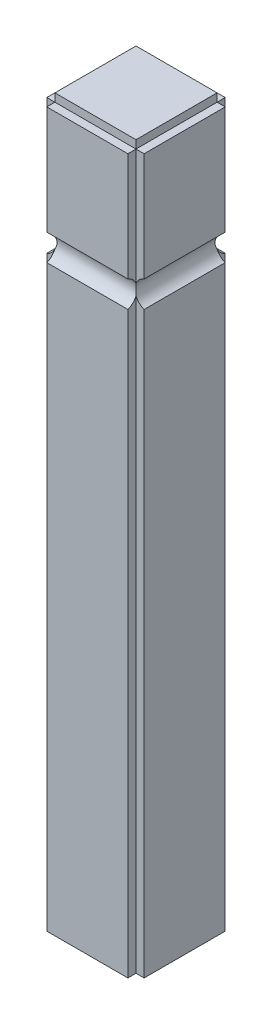
ISO-10303-21;
HEADER;
FILE_DESCRIPTION(('STEP AP214'),'2;1');
FILE_NAME('part.step','',(''),(''),'','','');
FILE_SCHEMA(('AUTOMOTIVE_DESIGN { 1 0 10303 214 1 1 1 1 }'));
ENDSEC;
DATA;
#1=APPLICATION_CONTEXT('core data for automotive mechanical design processes');
#2=APPLICATION_PROTOCOL_DEFINITION('international standard','automotive_design',2000,#1);
#3=PRODUCT_CONTEXT('',#1,'mechanical');
#4=PRODUCT('Part','Part','',(#3));
#5=PRODUCT_RELATED_PRODUCT_CATEGORY('part','',(#4));
#6=PRODUCT_DEFINITION_FORMATION('','',#4);
#7=PRODUCT_DEFINITION_CONTEXT('part definition',#1,'design');
#8=PRODUCT_DEFINITION('design','',#6,#7);
#9=PRODUCT_DEFINITION_SHAPE('','',#8);
#10=(LENGTH_UNIT() NAMED_UNIT(*) SI_UNIT(.MILLI.,.METRE.));
#11=(NAMED_UNIT(*) PLANE_ANGLE_UNIT() SI_UNIT($,.RADIAN.));
#12=(NAMED_UNIT(*) SI_UNIT($,.STERADIAN.) SOLID_ANGLE_UNIT());
#13=UNCERTAINTY_MEASURE_WITH_UNIT(LENGTH_MEASURE(1.E-05),#10,'distance_accuracy_value','');
#14=(GEOMETRIC_REPRESENTATION_CONTEXT(3) GLOBAL_UNCERTAINTY_ASSIGNED_CONTEXT((#13)) GLOBAL_UNIT_ASSIGNED_CONTEXT((#10,
#11,#12)) REPRESENTATION_CONTEXT('',''));
#15=CARTESIAN_POINT('',(0.,0.,0.));
#16=DIRECTION('',(0.,0.,1.));
#17=DIRECTION('',(1.,0.,0.));
#18=AXIS2_PLACEMENT_3D('',#15,#16,#17);
#19=CARTESIAN_POINT('',(0.,0.,0.));
#20=DIRECTION('',(0.,-1.,0.));
#21=DIRECTION('',(0.,0.,-1.));
#22=AXIS2_PLACEMENT_3D('',#19,#20,#21);
#23=PLANE('',#22);
#24=DIRECTION('',(0.,0.,1.));
#25=VECTOR('',#24,1.);
#26=CARTESIAN_POINT('',(15.,0.,-165.));
#27=LINE('',#26,#25);
#28=CARTESIAN_POINT('',(15.,0.,-165.));
#29=VERTEX_POINT('',#28);
#30=CARTESIAN_POINT('',(15.,0.,-15.));
#31=VERTEX_POINT('',#30);
#32=EDGE_CURVE('E235',#29,#31,#27,.T.);
#33=ORIENTED_EDGE('',*,*,#32,.F.);
#34=DIRECTION('',(1.,0.,0.));
#35=VECTOR('',#34,1.);
#36=CARTESIAN_POINT('',(0.,0.,-165.));
#37=LINE('',#36,#35);
#38=CARTESIAN_POINT('',(0.,0.,-165.));
#39=VERTEX_POINT('',#38);
#40=EDGE_CURVE('E346',#39,#29,#37,.T.);
#41=ORIENTED_EDGE('',*,*,#40,.F.);
#42=DIRECTION('',(0.,0.,1.));
#43=VECTOR('',#42,1.);
#44=CARTESIAN_POINT('',(0.,0.,0.));
#45=LINE('',#44,#43);
#46=CARTESIAN_POINT('',(0.,0.,-15.));
#47=VERTEX_POINT('',#46);
#48=EDGE_CURVE('E390',#39,#47,#45,.T.);
#49=ORIENTED_EDGE('',*,*,#48,.T.);
#50=DIRECTION('',(-1.,0.,0.));
#51=VECTOR('',#50,1.);
#52=CARTESIAN_POINT('',(0.,0.,-15.));
#53=LINE('',#52,#51);
#54=EDGE_CURVE('E333',#31,#47,#53,.T.);
#55=ORIENTED_EDGE('',*,*,#54,.F.);
#56=EDGE_LOOP('',(#33,#41,#49,#55));
#57=FACE_BOUND('',#56,.T.);
#58=ADVANCED_FACE('F34',(#57),#23,.F.);
#59=DIRECTION('',(-1.,0.,0.));
#60=VECTOR('',#59,1.);
#61=CARTESIAN_POINT('',(165.,0.,-165.));
#62=LINE('',#61,#60);
#63=CARTESIAN_POINT('',(165.,0.,-165.));
#64=VERTEX_POINT('',#63);
#65=EDGE_CURVE('E232',#64,#29,#62,.T.);
#66=ORIENTED_EDGE('',*,*,#65,.F.);
#67=DIRECTION('',(0.,0.,1.));
#68=VECTOR('',#67,1.);
#69=CARTESIAN_POINT('',(165.,0.,-180.));
#70=LINE('',#69,#68);
#71=CARTESIAN_POINT('',(165.,0.,-180.));
#72=VERTEX_POINT('',#71);
#73=EDGE_CURVE('E320',#72,#64,#70,.T.);
#74=ORIENTED_EDGE('',*,*,#73,.F.);
#75=DIRECTION('',(-1.,0.,0.));
#76=VECTOR('',#75,1.);
#77=CARTESIAN_POINT('',(0.,0.,-180.));
#78=LINE('',#77,#76);
#79=CARTESIAN_POINT('',(15.,0.,-180.));
#80=VERTEX_POINT('',#79);
#81=EDGE_CURVE('E403',#72,#80,#78,.T.);
#82=ORIENTED_EDGE('',*,*,#81,.T.);
#83=DIRECTION('',(0.,0.,-1.));
#84=VECTOR('',#83,1.);
#85=CARTESIAN_POINT('',(15.,0.,-180.));
#86=LINE('',#85,#84);
#87=EDGE_CURVE('E379',#29,#80,#86,.T.);
#88=ORIENTED_EDGE('',*,*,#87,.F.);
#89=EDGE_LOOP('',(#66,#74,#82,#88));
#90=FACE_BOUND('',#89,.T.);
#91=ADVANCED_FACE('F489',(#90),#23,.F.);
#92=DIRECTION('',(0.,0.,-1.));
#93=VECTOR('',#92,1.);
#94=CARTESIAN_POINT('',(165.,0.,-15.));
#95=LINE('',#94,#93);
#96=CARTESIAN_POINT('',(165.,0.,-15.));
#97=VERTEX_POINT('',#96);
#98=EDGE_CURVE('E510',#97,#64,#95,.T.);
#99=ORIENTED_EDGE('',*,*,#98,.F.);
#100=DIRECTION('',(-1.,0.,0.));
#101=VECTOR('',#100,1.);
#102=CARTESIAN_POINT('',(180.,0.,-15.));
#103=LINE('',#102,#101);
#104=CARTESIAN_POINT('',(180.,0.,-15.));
#105=VERTEX_POINT('',#104);
#106=EDGE_CURVE('E313',#105,#97,#103,.T.);
#107=ORIENTED_EDGE('',*,*,#106,.F.);
#108=DIRECTION('',(0.,0.,-1.));
#109=VECTOR('',#108,1.);
#110=CARTESIAN_POINT('',(180.,0.,0.));
#111=LINE('',#110,#109);
#112=CARTESIAN_POINT('',(180.,0.,-165.));
#113=VERTEX_POINT('',#112);
#114=EDGE_CURVE('E417',#105,#113,#111,.T.);
#115=ORIENTED_EDGE('',*,*,#114,.T.);
#116=DIRECTION('',(1.,0.,0.));
#117=VECTOR('',#116,1.);
#118=CARTESIAN_POINT('',(180.,0.,-165.));
#119=LINE('',#118,#117);
#120=EDGE_CURVE('E359',#64,#113,#119,.T.);
#121=ORIENTED_EDGE('',*,*,#120,.F.);
#122=EDGE_LOOP('',(#99,#107,#115,#121));
#123=FACE_BOUND('',#122,.T.);
#124=ADVANCED_FACE('F496',(#123),#23,.F.);
#125=DIRECTION('',(1.,0.,0.));
#126=VECTOR('',#125,1.);
#127=CARTESIAN_POINT('',(15.,0.,-15.));
#128=LINE('',#127,#126);
#129=EDGE_CURVE('E507',#31,#97,#128,.T.);
#130=ORIENTED_EDGE('',*,*,#129,.F.);
#131=DIRECTION('',(0.,0.,-1.));
#132=VECTOR('',#131,1.);
#133=CARTESIAN_POINT('',(15.,0.,0.));
#134=LINE('',#133,#132);
#135=CARTESIAN_POINT('',(15.,0.,0.));
#136=VERTEX_POINT('',#135);
#137=EDGE_CURVE('E337',#136,#31,#134,.T.);
#138=ORIENTED_EDGE('',*,*,#137,.F.);
#139=DIRECTION('',(1.,0.,0.));
#140=VECTOR('',#139,1.);
#141=CARTESIAN_POINT('',(0.,0.,0.));
#142=LINE('',#141,#140);
#143=CARTESIAN_POINT('',(165.,0.,0.));
#144=VERTEX_POINT('',#143);
#145=EDGE_CURVE('E414',#136,#144,#142,.T.);
#146=ORIENTED_EDGE('',*,*,#145,.T.);
#147=DIRECTION('',(0.,0.,1.));
#148=VECTOR('',#147,1.);
#149=CARTESIAN_POINT('',(165.,0.,0.));
#150=LINE('',#149,#148);
#151=EDGE_CURVE('E310',#97,#144,#150,.T.);
#152=ORIENTED_EDGE('',*,*,#151,.F.);
#153=EDGE_LOOP('',(#130,#138,#146,#152));
#154=FACE_BOUND('',#153,.T.);
#155=ADVANCED_FACE('F492',(#154),#23,.F.);
#156=CARTESIAN_POINT('',(0.,-1320.,-180.));
#157=DIRECTION('',(0.,0.,-1.));
#158=DIRECTION('',(-1.,0.,0.));
#159=AXIS2_PLACEMENT_3D('',#156,#157,#158);
#160=PLANE('',#159);
#161=DIRECTION('',(-1.,0.,0.));
#162=VECTOR('',#161,1.);
#163=CARTESIAN_POINT('',(180.,-249.392621835301,-180.));
#164=LINE('',#163,#162);
#165=CARTESIAN_POINT('',(165.,-249.392621835301,-180.));
#166=VERTEX_POINT('',#165);
#167=CARTESIAN_POINT('',(15.0000000000001,-249.392621835301,-180.));
#168=VERTEX_POINT('',#167);
#169=EDGE_CURVE('E245',#166,#168,#164,.T.);
#170=ORIENTED_EDGE('',*,*,#169,.F.);
#171=DIRECTION('',(0.,1.,0.));
#172=VECTOR('',#171,1.);
#173=CARTESIAN_POINT('',(165.,-1320.,-180.));
#174=LINE('',#173,#172);
#175=CARTESIAN_POINT('',(165.,-1320.,-180.));
#176=VERTEX_POINT('',#175);
#177=EDGE_CURVE('E372',#176,#166,#174,.T.);
#178=ORIENTED_EDGE('',*,*,#177,.F.);
#179=DIRECTION('',(-1.,0.,0.));
#180=VECTOR('',#179,1.);
#181=CARTESIAN_POINT('',(0.,-1320.,-180.));
#182=LINE('',#181,#180);
#183=CARTESIAN_POINT('',(15.,-1320.,-180.));
#184=VERTEX_POINT('',#183);
#185=EDGE_CURVE('E409',#176,#184,#182,.T.);
#186=ORIENTED_EDGE('',*,*,#185,.T.);
#187=DIRECTION('',(0.,1.,0.));
#188=VECTOR('',#187,1.);
#189=CARTESIAN_POINT('',(15.,-1320.,-180.));
#190=LINE('',#189,#188);
#191=EDGE_CURVE('E387',#184,#168,#190,.T.);
#192=ORIENTED_EDGE('',*,*,#191,.T.);
#193=EDGE_LOOP('',(#170,#178,#186,#192));
#194=FACE_BOUND('',#193,.T.);
#195=ADVANCED_FACE('F451',(#194),#160,.T.);
#196=CARTESIAN_POINT('',(0.,-1320.,0.));
#197=DIRECTION('',(0.,0.,1.));
#198=DIRECTION('',(1.,0.,0.));
#199=AXIS2_PLACEMENT_3D('',#196,#197,#198);
#200=PLANE('',#199);
#201=DIRECTION('',(-1.,0.,0.));
#202=VECTOR('',#201,1.);
#203=CARTESIAN_POINT('',(180.,-200.607378164699,0.));
#204=LINE('',#203,#202);
#205=CARTESIAN_POINT('',(165.,-200.607378164699,0.));
#206=VERTEX_POINT('',#205);
#207=CARTESIAN_POINT('',(15.,-200.607378164699,0.));
#208=VERTEX_POINT('',#207);
#209=EDGE_CURVE('E239',#206,#208,#204,.T.);
#210=ORIENTED_EDGE('',*,*,#209,.F.);
#211=DIRECTION('',(0.,1.,0.));
#212=VECTOR('',#211,1.);
#213=CARTESIAN_POINT('',(165.,-1320.,0.));
#214=LINE('',#213,#212);
#215=EDGE_CURVE('E321',#206,#144,#214,.T.);
#216=ORIENTED_EDGE('',*,*,#215,.T.);
#217=ORIENTED_EDGE('',*,*,#145,.F.);
#218=DIRECTION('',(0.,1.,0.));
#219=VECTOR('',#218,1.);
#220=CARTESIAN_POINT('',(15.,-1320.,0.));
#221=LINE('',#220,#219);
#222=EDGE_CURVE('E336',#208,#136,#221,.T.);
#223=ORIENTED_EDGE('',*,*,#222,.F.);
#224=EDGE_LOOP('',(#210,#216,#217,#223));
#225=FACE_BOUND('',#224,.T.);
#226=ADVANCED_FACE('F477',(#225),#200,.T.);
#227=CARTESIAN_POINT('',(0.,-1320.,0.));
#228=DIRECTION('',(-1.,0.,0.));
#229=DIRECTION('',(0.,0.,1.));
#230=AXIS2_PLACEMENT_3D('',#227,#228,#229);
#231=PLANE('',#230);
#232=DIRECTION('',(0.,0.,1.));
#233=VECTOR('',#232,1.);
#234=CARTESIAN_POINT('',(0.,-249.392621835301,-180.));
#235=LINE('',#234,#233);
#236=CARTESIAN_POINT('',(0.,-249.392621835301,-165.));
#237=VERTEX_POINT('',#236);
#238=CARTESIAN_POINT('',(0.,-249.392621835301,-15.0000000000001));
#239=VERTEX_POINT('',#238);
#240=EDGE_CURVE('E284',#237,#239,#235,.T.);
#241=ORIENTED_EDGE('',*,*,#240,.F.);
#242=DIRECTION('',(0.,1.,0.));
#243=VECTOR('',#242,1.);
#244=CARTESIAN_POINT('',(0.,-1320.,-165.));
#245=LINE('',#244,#243);
#246=CARTESIAN_POINT('',(0.,-1320.,-165.));
#247=VERTEX_POINT('',#246);
#248=EDGE_CURVE('E396',#247,#237,#245,.T.);
#249=ORIENTED_EDGE('',*,*,#248,.F.);
#250=DIRECTION('',(0.,0.,1.));
#251=VECTOR('',#250,1.);
#252=CARTESIAN_POINT('',(0.,-1320.,0.));
#253=LINE('',#252,#251);
#254=CARTESIAN_POINT('',(0.,-1320.,-15.));
#255=VERTEX_POINT('',#254);
#256=EDGE_CURVE('E399',#247,#255,#253,.T.);
#257=ORIENTED_EDGE('',*,*,#256,.T.);
#258=DIRECTION('',(0.,1.,0.));
#259=VECTOR('',#258,1.);
#260=CARTESIAN_POINT('',(0.,-1320.,-15.));
#261=LINE('',#260,#259);
#262=EDGE_CURVE('E343',#255,#239,#261,.T.);
#263=ORIENTED_EDGE('',*,*,#262,.T.);
#264=EDGE_LOOP('',(#241,#249,#257,#263));
#265=FACE_BOUND('',#264,.T.);
#266=ADVANCED_FACE('F462',(#265),#231,.T.);
#267=CARTESIAN_POINT('',(180.,-1320.,0.));
#268=DIRECTION('',(1.,0.,0.));
#269=DIRECTION('',(0.,0.,-1.));
#270=AXIS2_PLACEMENT_3D('',#267,#268,#269);
#271=PLANE('',#270);
#272=DIRECTION('',(0.,0.,1.));
#273=VECTOR('',#272,1.);
#274=CARTESIAN_POINT('',(180.,-200.607378164699,-180.));
#275=LINE('',#274,#273);
#276=CARTESIAN_POINT('',(180.,-200.607378164699,-165.));
#277=VERTEX_POINT('',#276);
#278=CARTESIAN_POINT('',(180.,-200.607378164699,-15.));
#279=VERTEX_POINT('',#278);
#280=EDGE_CURVE('E285',#277,#279,#275,.T.);
#281=ORIENTED_EDGE('',*,*,#280,.F.);
#282=DIRECTION('',(0.,1.,0.));
#283=VECTOR('',#282,1.);
#284=CARTESIAN_POINT('',(180.,-1320.,-165.));
#285=LINE('',#284,#283);
#286=EDGE_CURVE('E367',#277,#113,#285,.T.);
#287=ORIENTED_EDGE('',*,*,#286,.T.);
#288=ORIENTED_EDGE('',*,*,#114,.F.);
#289=DIRECTION('',(0.,1.,0.));
#290=VECTOR('',#289,1.);
#291=CARTESIAN_POINT('',(180.,-1320.,-15.));
#292=LINE('',#291,#290);
#293=EDGE_CURVE('E57',#279,#105,#292,.T.);
#294=ORIENTED_EDGE('',*,*,#293,.F.);
#295=EDGE_LOOP('',(#281,#287,#288,#294));
#296=FACE_BOUND('',#295,.T.);
#297=ADVANCED_FACE('F485',(#296),#271,.T.);
#298=CARTESIAN_POINT('',(15.,-1320.,-180.));
#299=DIRECTION('',(1.,0.,0.));
#300=DIRECTION('',(0.,0.,-1.));
#301=AXIS2_PLACEMENT_3D('',#298,#299,#300);
#302=PLANE('',#301);
#303=CARTESIAN_POINT('',(15.0000000000001,-200.607378164699,-180.));
#304=VERTEX_POINT('',#303);
#305=EDGE_CURVE('E391',#304,#80,#190,.T.);
#306=ORIENTED_EDGE('',*,*,#305,.F.);
#307=CARTESIAN_POINT('',(15.,-225.,-189.));
#308=DIRECTION('',(1.,0.,0.));
#309=DIRECTION('',(0.,0.,-1.));
#310=AXIS2_PLACEMENT_3D('',#307,#308,#309);
#311=CIRCLE('',#310,26.);
#312=CARTESIAN_POINT('',(15.,-215.,-165.));
#313=VERTEX_POINT('',#312);
#314=EDGE_CURVE('E277',#304,#313,#311,.T.);
#315=ORIENTED_EDGE('',*,*,#314,.T.);
#316=DIRECTION('',(0.,1.,0.));
#317=VECTOR('',#316,1.);
#318=CARTESIAN_POINT('',(15.,-1320.,-165.));
#319=LINE('',#318,#317);
#320=EDGE_CURVE('E395',#313,#29,#319,.T.);
#321=ORIENTED_EDGE('',*,*,#320,.T.);
#322=ORIENTED_EDGE('',*,*,#87,.T.);
#323=EDGE_LOOP('',(#306,#315,#321,#322));
#324=FACE_BOUND('',#323,.T.);
#325=ADVANCED_FACE('F533',(#324),#302,.F.);
#326=CARTESIAN_POINT('',(0.,-1320.,-165.));
#327=DIRECTION('',(0.,0.,1.));
#328=DIRECTION('',(1.,0.,0.));
#329=AXIS2_PLACEMENT_3D('',#326,#327,#328);
#330=PLANE('',#329);
#331=ORIENTED_EDGE('',*,*,#320,.F.);
#332=CARTESIAN_POINT('',(-9.,-225.,-165.));
#333=DIRECTION('',(0.,0.,1.));
#334=DIRECTION('',(1.,0.,0.));
#335=AXIS2_PLACEMENT_3D('',#332,#333,#334);
#336=CIRCLE('',#335,26.);
#337=CARTESIAN_POINT('',(0.,-200.607378164699,-165.));
#338=VERTEX_POINT('',#337);
#339=EDGE_CURVE('E297',#313,#338,#336,.T.);
#340=ORIENTED_EDGE('',*,*,#339,.T.);
#341=EDGE_CURVE('E382',#338,#39,#245,.T.);
#342=ORIENTED_EDGE('',*,*,#341,.T.);
#343=ORIENTED_EDGE('',*,*,#40,.T.);
#344=EDGE_LOOP('',(#331,#340,#342,#343));
#345=FACE_BOUND('',#344,.T.);
#346=ADVANCED_FACE('F529',(#345),#330,.F.);
#347=CARTESIAN_POINT('',(165.,-1320.,0.));
#348=DIRECTION('',(-1.,0.,0.));
#349=DIRECTION('',(0.,0.,1.));
#350=AXIS2_PLACEMENT_3D('',#347,#348,#349);
#351=PLANE('',#350);
#352=DIRECTION('',(0.,1.,0.));
#353=VECTOR('',#352,1.);
#354=CARTESIAN_POINT('',(165.,-1320.,-15.));
#355=LINE('',#354,#353);
#356=CARTESIAN_POINT('',(165.,-1320.,-15.));
#357=VERTEX_POINT('',#356);
#358=CARTESIAN_POINT('',(165.,-235.,-15.));
#359=VERTEX_POINT('',#358);
#360=EDGE_CURVE('E322',#357,#359,#355,.T.);
#361=ORIENTED_EDGE('',*,*,#360,.T.);
#362=CARTESIAN_POINT('',(165.,-225.,9.));
#363=DIRECTION('',(-1.,0.,0.));
#364=DIRECTION('',(0.,0.,1.));
#365=AXIS2_PLACEMENT_3D('',#362,#363,#364);
#366=CIRCLE('',#365,26.);
#367=CARTESIAN_POINT('',(165.,-249.392621835301,0.));
#368=VERTEX_POINT('',#367);
#369=EDGE_CURVE('E254',#359,#368,#366,.T.);
#370=ORIENTED_EDGE('',*,*,#369,.T.);
#371=CARTESIAN_POINT('',(165.,-1320.,0.));
#372=VERTEX_POINT('',#371);
#373=EDGE_CURVE('E317',#372,#368,#214,.T.);
#374=ORIENTED_EDGE('',*,*,#373,.F.);
#375=DIRECTION('',(0.,0.,1.));
#376=VECTOR('',#375,1.);
#377=CARTESIAN_POINT('',(165.,-1320.,0.));
#378=LINE('',#377,#376);
#379=EDGE_CURVE('E309',#357,#372,#378,.T.);
#380=ORIENTED_EDGE('',*,*,#379,.F.);
#381=EDGE_LOOP('',(#361,#370,#374,#380));
#382=FACE_BOUND('',#381,.T.);
#383=ADVANCED_FACE('F433',(#382),#351,.F.);
#384=CARTESIAN_POINT('',(180.,-1320.,-15.));
#385=DIRECTION('',(0.,0.,-1.));
#386=DIRECTION('',(-1.,0.,0.));
#387=AXIS2_PLACEMENT_3D('',#384,#385,#386);
#388=PLANE('',#387);
#389=CARTESIAN_POINT('',(165.,-215.,-15.));
#390=VERTEX_POINT('',#389);
#391=EDGE_CURVE('E325',#390,#97,#355,.T.);
#392=ORIENTED_EDGE('',*,*,#391,.F.);
#393=CARTESIAN_POINT('',(189.,-225.,-15.));
#394=DIRECTION('',(0.,0.,-1.));
#395=DIRECTION('',(-1.,0.,0.));
#396=AXIS2_PLACEMENT_3D('',#393,#394,#395);
#397=CIRCLE('',#396,26.);
#398=EDGE_CURVE('E305',#390,#279,#397,.T.);
#399=ORIENTED_EDGE('',*,*,#398,.T.);
#400=ORIENTED_EDGE('',*,*,#293,.T.);
#401=ORIENTED_EDGE('',*,*,#106,.T.);
#402=EDGE_LOOP('',(#392,#399,#400,#401));
#403=FACE_BOUND('',#402,.T.);
#404=ADVANCED_FACE('F586',(#403),#388,.F.);
#405=CARTESIAN_POINT('',(180.,-1320.,-165.));
#406=DIRECTION('',(0.,0.,1.));
#407=DIRECTION('',(1.,0.,0.));
#408=AXIS2_PLACEMENT_3D('',#405,#406,#407);
#409=PLANE('',#408);
#410=ORIENTED_EDGE('',*,*,#286,.F.);
#411=CARTESIAN_POINT('',(189.,-225.,-165.));
#412=DIRECTION('',(0.,0.,1.));
#413=DIRECTION('',(1.,0.,0.));
#414=AXIS2_PLACEMENT_3D('',#411,#412,#413);
#415=CIRCLE('',#414,26.);
#416=CARTESIAN_POINT('',(165.,-215.,-165.));
#417=VERTEX_POINT('',#416);
#418=EDGE_CURVE('E298',#277,#417,#415,.T.);
#419=ORIENTED_EDGE('',*,*,#418,.T.);
#420=DIRECTION('',(0.,1.,0.));
#421=VECTOR('',#420,1.);
#422=CARTESIAN_POINT('',(165.,-1320.,-165.));
#423=LINE('',#422,#421);
#424=EDGE_CURVE('E371',#417,#64,#423,.T.);
#425=ORIENTED_EDGE('',*,*,#424,.T.);
#426=ORIENTED_EDGE('',*,*,#120,.T.);
#427=EDGE_LOOP('',(#410,#419,#425,#426));
#428=FACE_BOUND('',#427,.T.);
#429=ADVANCED_FACE('F593',(#428),#409,.F.);
#430=CARTESIAN_POINT('',(165.,-1320.,-180.));
#431=DIRECTION('',(-1.,0.,0.));
#432=DIRECTION('',(0.,0.,1.));
#433=AXIS2_PLACEMENT_3D('',#430,#431,#432);
#434=PLANE('',#433);
#435=ORIENTED_EDGE('',*,*,#177,.T.);
#436=CARTESIAN_POINT('',(165.,-225.,-189.));
#437=DIRECTION('',(-1.,0.,0.));
#438=DIRECTION('',(0.,0.,1.));
#439=AXIS2_PLACEMENT_3D('',#436,#437,#438);
#440=CIRCLE('',#439,26.);
#441=CARTESIAN_POINT('',(165.,-235.,-165.));
#442=VERTEX_POINT('',#441);
#443=EDGE_CURVE('E268',#166,#442,#440,.T.);
#444=ORIENTED_EDGE('',*,*,#443,.T.);
#445=CARTESIAN_POINT('',(165.,-1320.,-165.));
#446=VERTEX_POINT('',#445);
#447=EDGE_CURVE('E368',#446,#442,#423,.T.);
#448=ORIENTED_EDGE('',*,*,#447,.F.);
#449=DIRECTION('',(0.,0.,1.));
#450=VECTOR('',#449,1.);
#451=CARTESIAN_POINT('',(165.,-1320.,-180.));
#452=LINE('',#451,#450);
#453=EDGE_CURVE('E355',#176,#446,#452,.T.);
#454=ORIENTED_EDGE('',*,*,#453,.F.);
#455=EDGE_LOOP('',(#435,#444,#448,#454));
#456=FACE_BOUND('',#455,.T.);
#457=ADVANCED_FACE('F445',(#456),#434,.F.);
#458=CARTESIAN_POINT('',(0.,-1320.,-15.));
#459=DIRECTION('',(0.,0.,-1.));
#460=DIRECTION('',(-1.,0.,0.));
#461=AXIS2_PLACEMENT_3D('',#458,#459,#460);
#462=PLANE('',#461);
#463=CARTESIAN_POINT('',(0.,-200.607378164699,-15.0000000000001));
#464=VERTEX_POINT('',#463);
#465=EDGE_CURVE('E347',#464,#47,#261,.T.);
#466=ORIENTED_EDGE('',*,*,#465,.F.);
#467=CARTESIAN_POINT('',(-9.,-225.,-15.));
#468=DIRECTION('',(0.,0.,-1.));
#469=DIRECTION('',(-1.,0.,0.));
#470=AXIS2_PLACEMENT_3D('',#467,#468,#469);
#471=CIRCLE('',#470,26.);
#472=CARTESIAN_POINT('',(15.0000000000001,-215.,-15.));
#473=VERTEX_POINT('',#472);
#474=EDGE_CURVE('E293',#464,#473,#471,.T.);
#475=ORIENTED_EDGE('',*,*,#474,.T.);
#476=DIRECTION('',(0.,1.,0.));
#477=VECTOR('',#476,1.);
#478=CARTESIAN_POINT('',(15.,-1320.,-15.));
#479=LINE('',#478,#477);
#480=EDGE_CURVE('E351',#473,#31,#479,.T.);
#481=ORIENTED_EDGE('',*,*,#480,.T.);
#482=ORIENTED_EDGE('',*,*,#54,.T.);
#483=EDGE_LOOP('',(#466,#475,#481,#482));
#484=FACE_BOUND('',#483,.T.);
#485=ADVANCED_FACE('F516',(#484),#462,.F.);
#486=CARTESIAN_POINT('',(15.,-1320.,0.));
#487=DIRECTION('',(1.,0.,0.));
#488=DIRECTION('',(0.,0.,-1.));
#489=AXIS2_PLACEMENT_3D('',#486,#487,#488);
#490=PLANE('',#489);
#491=ORIENTED_EDGE('',*,*,#480,.F.);
#492=CARTESIAN_POINT('',(15.,-225.,9.));
#493=DIRECTION('',(1.,0.,0.));
#494=DIRECTION('',(0.,0.,-1.));
#495=AXIS2_PLACEMENT_3D('',#492,#493,#494);
#496=CIRCLE('',#495,26.);
#497=EDGE_CURVE('E263',#473,#208,#496,.T.);
#498=ORIENTED_EDGE('',*,*,#497,.T.);
#499=ORIENTED_EDGE('',*,*,#222,.T.);
#500=ORIENTED_EDGE('',*,*,#137,.T.);
#501=EDGE_LOOP('',(#491,#498,#499,#500));
#502=FACE_BOUND('',#501,.T.);
#503=ADVANCED_FACE('F519',(#502),#490,.F.);
#504=DIRECTION('',(0.,0.,1.));
#505=VECTOR('',#504,1.);
#506=CARTESIAN_POINT('',(0.,-200.607378164699,-180.));
#507=LINE('',#506,#505);
#508=EDGE_CURVE('E281',#338,#464,#507,.T.);
#509=ORIENTED_EDGE('',*,*,#508,.T.);
#510=ORIENTED_EDGE('',*,*,#465,.T.);
#511=ORIENTED_EDGE('',*,*,#48,.F.);
#512=ORIENTED_EDGE('',*,*,#341,.F.);
#513=EDGE_LOOP('',(#509,#510,#511,#512));
#514=FACE_BOUND('',#513,.T.);
#515=ADVANCED_FACE('F36',(#514),#231,.T.);
#516=DIRECTION('',(-1.,0.,0.));
#517=VECTOR('',#516,1.);
#518=CARTESIAN_POINT('',(180.,-200.607378164699,-180.));
#519=LINE('',#518,#517);
#520=CARTESIAN_POINT('',(165.,-200.607378164699,-180.));
#521=VERTEX_POINT('',#520);
#522=EDGE_CURVE('E248',#521,#304,#519,.T.);
#523=ORIENTED_EDGE('',*,*,#522,.T.);
#524=ORIENTED_EDGE('',*,*,#305,.T.);
#525=ORIENTED_EDGE('',*,*,#81,.F.);
#526=EDGE_CURVE('E49',#521,#72,#174,.T.);
#527=ORIENTED_EDGE('',*,*,#526,.F.);
#528=EDGE_LOOP('',(#523,#524,#525,#527));
#529=FACE_BOUND('',#528,.T.);
#530=ADVANCED_FACE('F483',(#529),#160,.T.);
#531=DIRECTION('',(0.,0.,1.));
#532=VECTOR('',#531,1.);
#533=CARTESIAN_POINT('',(180.,-249.392621835301,-180.));
#534=LINE('',#533,#532);
#535=CARTESIAN_POINT('',(180.,-249.392621835301,-165.));
#536=VERTEX_POINT('',#535);
#537=CARTESIAN_POINT('',(180.,-249.392621835301,-15.));
#538=VERTEX_POINT('',#537);
#539=EDGE_CURVE('E280',#536,#538,#534,.T.);
#540=ORIENTED_EDGE('',*,*,#539,.T.);
#541=CARTESIAN_POINT('',(180.,-1320.,-15.));
#542=VERTEX_POINT('',#541);
#543=EDGE_CURVE('E326',#542,#538,#292,.T.);
#544=ORIENTED_EDGE('',*,*,#543,.F.);
#545=DIRECTION('',(0.,0.,-1.));
#546=VECTOR('',#545,1.);
#547=CARTESIAN_POINT('',(180.,-1320.,0.));
#548=LINE('',#547,#546);
#549=CARTESIAN_POINT('',(180.,-1320.,-165.));
#550=VERTEX_POINT('',#549);
#551=EDGE_CURVE('E406',#542,#550,#548,.T.);
#552=ORIENTED_EDGE('',*,*,#551,.T.);
#553=EDGE_CURVE('E340',#550,#536,#285,.T.);
#554=ORIENTED_EDGE('',*,*,#553,.T.);
#555=EDGE_LOOP('',(#540,#544,#552,#554));
#556=FACE_BOUND('',#555,.T.);
#557=ADVANCED_FACE('F439',(#556),#271,.T.);
#558=DIRECTION('',(-1.,0.,0.));
#559=VECTOR('',#558,1.);
#560=CARTESIAN_POINT('',(180.,-249.392621835301,0.));
#561=LINE('',#560,#559);
#562=CARTESIAN_POINT('',(15.,-249.392621835301,0.));
#563=VERTEX_POINT('',#562);
#564=EDGE_CURVE('E236',#368,#563,#561,.T.);
#565=ORIENTED_EDGE('',*,*,#564,.T.);
#566=CARTESIAN_POINT('',(15.,-1320.,0.));
#567=VERTEX_POINT('',#566);
#568=EDGE_CURVE('E352',#567,#563,#221,.T.);
#569=ORIENTED_EDGE('',*,*,#568,.F.);
#570=DIRECTION('',(1.,0.,0.));
#571=VECTOR('',#570,1.);
#572=CARTESIAN_POINT('',(0.,-1320.,0.));
#573=LINE('',#572,#571);
#574=EDGE_CURVE('E402',#567,#372,#573,.T.);
#575=ORIENTED_EDGE('',*,*,#574,.T.);
#576=ORIENTED_EDGE('',*,*,#373,.T.);
#577=EDGE_LOOP('',(#565,#569,#575,#576));
#578=FACE_BOUND('',#577,.T.);
#579=ADVANCED_FACE('F475',(#578),#200,.T.);
#580=CARTESIAN_POINT('',(0.,-1320.,0.));
#581=DIRECTION('',(0.,-1.,0.));
#582=DIRECTION('',(0.,0.,-1.));
#583=AXIS2_PLACEMENT_3D('',#580,#581,#582);
#584=PLANE('',#583);
#585=DIRECTION('',(-1.,0.,0.));
#586=VECTOR('',#585,1.);
#587=CARTESIAN_POINT('',(0.,-1320.,-15.));
#588=LINE('',#587,#586);
#589=CARTESIAN_POINT('',(15.,-1320.,-15.));
#590=VERTEX_POINT('',#589);
#591=EDGE_CURVE('E332',#590,#255,#588,.T.);
#592=ORIENTED_EDGE('',*,*,#591,.T.);
#593=ORIENTED_EDGE('',*,*,#256,.F.);
#594=DIRECTION('',(1.,0.,0.));
#595=VECTOR('',#594,1.);
#596=CARTESIAN_POINT('',(0.,-1320.,-165.));
#597=LINE('',#596,#595);
#598=CARTESIAN_POINT('',(15.,-1320.,-165.));
#599=VERTEX_POINT('',#598);
#600=EDGE_CURVE('E375',#247,#599,#597,.T.);
#601=ORIENTED_EDGE('',*,*,#600,.T.);
#602=DIRECTION('',(0.,0.,-1.));
#603=VECTOR('',#602,1.);
#604=CARTESIAN_POINT('',(15.,-1320.,-180.));
#605=LINE('',#604,#603);
#606=EDGE_CURVE('E378',#599,#184,#605,.T.);
#607=ORIENTED_EDGE('',*,*,#606,.T.);
#608=ORIENTED_EDGE('',*,*,#185,.F.);
#609=ORIENTED_EDGE('',*,*,#453,.T.);
#610=DIRECTION('',(1.,0.,0.));
#611=VECTOR('',#610,1.);
#612=CARTESIAN_POINT('',(180.,-1320.,-165.));
#613=LINE('',#612,#611);
#614=EDGE_CURVE('E358',#446,#550,#613,.T.);
#615=ORIENTED_EDGE('',*,*,#614,.T.);
#616=ORIENTED_EDGE('',*,*,#551,.F.);
#617=DIRECTION('',(-1.,0.,0.));
#618=VECTOR('',#617,1.);
#619=CARTESIAN_POINT('',(180.,-1320.,-15.));
#620=LINE('',#619,#618);
#621=EDGE_CURVE('E306',#542,#357,#620,.T.);
#622=ORIENTED_EDGE('',*,*,#621,.T.);
#623=ORIENTED_EDGE('',*,*,#379,.T.);
#624=ORIENTED_EDGE('',*,*,#574,.F.);
#625=DIRECTION('',(0.,0.,-1.));
#626=VECTOR('',#625,1.);
#627=CARTESIAN_POINT('',(15.,-1320.,0.));
#628=LINE('',#627,#626);
#629=EDGE_CURVE('E329',#567,#590,#628,.T.);
#630=ORIENTED_EDGE('',*,*,#629,.T.);
#631=EDGE_LOOP('',(#592,#593,#601,#607,#608,#609,#615,#616,#622,#623,#624,#630));
#632=FACE_BOUND('',#631,.T.);
#633=ADVANCED_FACE('F437',(#632),#584,.T.);
#634=CARTESIAN_POINT('',(15.0000000000001,-235.,-165.));
#635=VERTEX_POINT('',#634);
#636=EDGE_CURVE('E392',#599,#635,#319,.T.);
#637=ORIENTED_EDGE('',*,*,#636,.T.);
#638=CARTESIAN_POINT('',(15.,-225.,-189.));
#639=DIRECTION('',(1.,0.,0.));
#640=DIRECTION('',(0.,0.,-1.));
#641=AXIS2_PLACEMENT_3D('',#638,#639,#640);
#642=CIRCLE('',#641,26.);
#643=EDGE_CURVE('E274',#635,#168,#642,.T.);
#644=ORIENTED_EDGE('',*,*,#643,.T.);
#645=ORIENTED_EDGE('',*,*,#191,.F.);
#646=ORIENTED_EDGE('',*,*,#606,.F.);
#647=EDGE_LOOP('',(#637,#644,#645,#646));
#648=FACE_BOUND('',#647,.T.);
#649=ADVANCED_FACE('F455',(#648),#302,.F.);
#650=ORIENTED_EDGE('',*,*,#248,.T.);
#651=EDGE_CURVE('E294',#237,#635,#336,.T.);
#652=ORIENTED_EDGE('',*,*,#651,.T.);
#653=ORIENTED_EDGE('',*,*,#636,.F.);
#654=ORIENTED_EDGE('',*,*,#600,.F.);
#655=EDGE_LOOP('',(#650,#652,#653,#654));
#656=FACE_BOUND('',#655,.T.);
#657=ADVANCED_FACE('F459',(#656),#330,.F.);
#658=ORIENTED_EDGE('',*,*,#215,.F.);
#659=CARTESIAN_POINT('',(165.,-225.,9.));
#660=DIRECTION('',(-1.,0.,0.));
#661=DIRECTION('',(0.,0.,1.));
#662=AXIS2_PLACEMENT_3D('',#659,#660,#661);
#663=CIRCLE('',#662,26.);
#664=EDGE_CURVE('E247',#206,#390,#663,.T.);
#665=ORIENTED_EDGE('',*,*,#664,.T.);
#666=ORIENTED_EDGE('',*,*,#391,.T.);
#667=ORIENTED_EDGE('',*,*,#151,.T.);
#668=EDGE_LOOP('',(#658,#665,#666,#667));
#669=FACE_BOUND('',#668,.T.);
#670=ADVANCED_FACE('F580',(#669),#351,.F.);
#671=ORIENTED_EDGE('',*,*,#543,.T.);
#672=EDGE_CURVE('E302',#538,#359,#397,.T.);
#673=ORIENTED_EDGE('',*,*,#672,.T.);
#674=ORIENTED_EDGE('',*,*,#360,.F.);
#675=ORIENTED_EDGE('',*,*,#621,.F.);
#676=EDGE_LOOP('',(#671,#673,#674,#675));
#677=FACE_BOUND('',#676,.T.);
#678=ADVANCED_FACE('F429',(#677),#388,.F.);
#679=ORIENTED_EDGE('',*,*,#447,.T.);
#680=EDGE_CURVE('E301',#442,#536,#415,.T.);
#681=ORIENTED_EDGE('',*,*,#680,.T.);
#682=ORIENTED_EDGE('',*,*,#553,.F.);
#683=ORIENTED_EDGE('',*,*,#614,.F.);
#684=EDGE_LOOP('',(#679,#681,#682,#683));
#685=FACE_BOUND('',#684,.T.);
#686=ADVANCED_FACE('F442',(#685),#409,.F.);
#687=ORIENTED_EDGE('',*,*,#424,.F.);
#688=CARTESIAN_POINT('',(165.,-225.,-189.));
#689=DIRECTION('',(-1.,0.,0.));
#690=DIRECTION('',(0.,0.,1.));
#691=AXIS2_PLACEMENT_3D('',#688,#689,#690);
#692=CIRCLE('',#691,26.);
#693=EDGE_CURVE('E266',#417,#521,#692,.T.);
#694=ORIENTED_EDGE('',*,*,#693,.T.);
#695=ORIENTED_EDGE('',*,*,#526,.T.);
#696=ORIENTED_EDGE('',*,*,#73,.T.);
#697=EDGE_LOOP('',(#687,#694,#695,#696));
#698=FACE_BOUND('',#697,.T.);
#699=ADVANCED_FACE('F540',(#698),#434,.F.);
#700=CARTESIAN_POINT('',(15.,-235.,-14.9999999999999));
#701=VERTEX_POINT('',#700);
#702=EDGE_CURVE('E348',#590,#701,#479,.T.);
#703=ORIENTED_EDGE('',*,*,#702,.T.);
#704=EDGE_CURVE('E287',#701,#239,#471,.T.);
#705=ORIENTED_EDGE('',*,*,#704,.T.);
#706=ORIENTED_EDGE('',*,*,#262,.F.);
#707=ORIENTED_EDGE('',*,*,#591,.F.);
#708=EDGE_LOOP('',(#703,#705,#706,#707));
#709=FACE_BOUND('',#708,.T.);
#710=ADVANCED_FACE('F468',(#709),#462,.F.);
#711=ORIENTED_EDGE('',*,*,#568,.T.);
#712=CARTESIAN_POINT('',(15.,-225.,9.));
#713=DIRECTION('',(1.,0.,0.));
#714=DIRECTION('',(0.,0.,-1.));
#715=AXIS2_PLACEMENT_3D('',#712,#713,#714);
#716=CIRCLE('',#715,26.);
#717=EDGE_CURVE('E260',#563,#701,#716,.T.);
#718=ORIENTED_EDGE('',*,*,#717,.T.);
#719=ORIENTED_EDGE('',*,*,#702,.F.);
#720=ORIENTED_EDGE('',*,*,#629,.F.);
#721=EDGE_LOOP('',(#711,#718,#719,#720));
#722=FACE_BOUND('',#721,.T.);
#723=ADVANCED_FACE('F471',(#722),#490,.F.);
#724=CARTESIAN_POINT('',(-9.,-225.,-180.));
#725=DIRECTION('',(0.,0.,1.));
#726=DIRECTION('',(1.,0.,0.));
#727=AXIS2_PLACEMENT_3D('',#724,#725,#726);
#728=CYLINDRICAL_SURFACE('',#727,26.);
#729=ORIENTED_EDGE('',*,*,#339,.F.);
#730=CARTESIAN_POINT('',(-8.99999999999998,-225.,-189.));
#731=DIRECTION('',(-0.707106781186547,0.,0.707106781186547));
#732=DIRECTION('',(0.707106781186547,0.,0.707106781186547));
#733=AXIS2_PLACEMENT_3D('',#730,#731,#732);
#734=ELLIPSE('',#733,36.7695526217005,26.);
#735=EDGE_CURVE('E271',#313,#635,#734,.F.);
#736=ORIENTED_EDGE('',*,*,#735,.T.);
#737=ORIENTED_EDGE('',*,*,#651,.F.);
#738=ORIENTED_EDGE('',*,*,#240,.T.);
#739=ORIENTED_EDGE('',*,*,#704,.F.);
#740=CARTESIAN_POINT('',(-8.99999999999998,-225.,9.00000000000002));
#741=DIRECTION('',(0.707106781186547,0.,0.707106781186547));
#742=DIRECTION('',(-0.707106781186547,0.,0.707106781186547));
#743=AXIS2_PLACEMENT_3D('',#740,#741,#742);
#744=ELLIPSE('',#743,36.7695526217005,26.);
#745=EDGE_CURVE('E257',#701,#473,#744,.T.);
#746=ORIENTED_EDGE('',*,*,#745,.T.);
#747=ORIENTED_EDGE('',*,*,#474,.F.);
#748=ORIENTED_EDGE('',*,*,#508,.F.);
#749=EDGE_LOOP('',(#729,#736,#737,#738,#739,#746,#747,#748));
#750=FACE_BOUND('',#749,.T.);
#751=ADVANCED_FACE('F466',(#750),#728,.F.);
#752=CARTESIAN_POINT('',(189.,-225.,-180.));
#753=DIRECTION('',(0.,0.,1.));
#754=DIRECTION('',(1.,0.,0.));
#755=AXIS2_PLACEMENT_3D('',#752,#753,#754);
#756=CYLINDRICAL_SURFACE('',#755,26.);
#757=ORIENTED_EDGE('',*,*,#680,.F.);
#758=CARTESIAN_POINT('',(189.,-225.,-189.));
#759=DIRECTION('',(0.707106781186547,0.,0.707106781186547));
#760=DIRECTION('',(-0.707106781186547,0.,0.707106781186547));
#761=AXIS2_PLACEMENT_3D('',#758,#759,#760);
#762=ELLIPSE('',#761,36.7695526217005,26.);
#763=EDGE_CURVE('E11',#442,#417,#762,.F.);
#764=ORIENTED_EDGE('',*,*,#763,.T.);
#765=ORIENTED_EDGE('',*,*,#418,.F.);
#766=ORIENTED_EDGE('',*,*,#280,.T.);
#767=ORIENTED_EDGE('',*,*,#398,.F.);
#768=CARTESIAN_POINT('',(189.,-225.,9.00000000000002));
#769=DIRECTION('',(-0.707106781186547,0.,0.707106781186547));
#770=DIRECTION('',(0.707106781186547,0.,0.707106781186547));
#771=AXIS2_PLACEMENT_3D('',#768,#769,#770);
#772=ELLIPSE('',#771,36.7695526217005,26.);
#773=EDGE_CURVE('E42',#390,#359,#772,.T.);
#774=ORIENTED_EDGE('',*,*,#773,.T.);
#775=ORIENTED_EDGE('',*,*,#672,.F.);
#776=ORIENTED_EDGE('',*,*,#539,.F.);
#777=EDGE_LOOP('',(#757,#764,#765,#766,#767,#774,#775,#776));
#778=FACE_BOUND('',#777,.T.);
#779=ADVANCED_FACE('F425',(#778),#756,.F.);
#780=CARTESIAN_POINT('',(180.,-225.,9.));
#781=DIRECTION('',(-1.,0.,0.));
#782=DIRECTION('',(0.,0.,1.));
#783=AXIS2_PLACEMENT_3D('',#780,#781,#782);
#784=CYLINDRICAL_SURFACE('',#783,26.);
#785=ORIENTED_EDGE('',*,*,#745,.F.);
#786=ORIENTED_EDGE('',*,*,#717,.F.);
#787=ORIENTED_EDGE('',*,*,#564,.F.);
#788=ORIENTED_EDGE('',*,*,#369,.F.);
#789=ORIENTED_EDGE('',*,*,#773,.F.);
#790=ORIENTED_EDGE('',*,*,#664,.F.);
#791=ORIENTED_EDGE('',*,*,#209,.T.);
#792=ORIENTED_EDGE('',*,*,#497,.F.);
#793=EDGE_LOOP('',(#785,#786,#787,#788,#789,#790,#791,#792));
#794=FACE_BOUND('',#793,.T.);
#795=ADVANCED_FACE('F473',(#794),#784,.F.);
#796=CARTESIAN_POINT('',(180.,-225.,-189.));
#797=DIRECTION('',(-1.,0.,0.));
#798=DIRECTION('',(0.,0.,1.));
#799=AXIS2_PLACEMENT_3D('',#796,#797,#798);
#800=CYLINDRICAL_SURFACE('',#799,26.);
#801=ORIENTED_EDGE('',*,*,#522,.F.);
#802=ORIENTED_EDGE('',*,*,#693,.F.);
#803=ORIENTED_EDGE('',*,*,#763,.F.);
#804=ORIENTED_EDGE('',*,*,#443,.F.);
#805=ORIENTED_EDGE('',*,*,#169,.T.);
#806=ORIENTED_EDGE('',*,*,#643,.F.);
#807=ORIENTED_EDGE('',*,*,#735,.F.);
#808=ORIENTED_EDGE('',*,*,#314,.F.);
#809=EDGE_LOOP('',(#801,#802,#803,#804,#805,#806,#807,#808));
#810=FACE_BOUND('',#809,.T.);
#811=ADVANCED_FACE('F449',(#810),#800,.F.);
#812=CARTESIAN_POINT('',(15.,15.,-165.));
#813=DIRECTION('',(1.,0.,0.));
#814=DIRECTION('',(0.,0.,-1.));
#815=AXIS2_PLACEMENT_3D('',#812,#813,#814);
#816=PLANE('',#815);
#817=ORIENTED_EDGE('',*,*,#32,.T.);
#818=DIRECTION('',(0.,-1.,0.));
#819=VECTOR('',#818,1.);
#820=CARTESIAN_POINT('',(15.,15.,-15.));
#821=LINE('',#820,#819);
#822=CARTESIAN_POINT('',(15.,15.,-15.));
#823=VERTEX_POINT('',#822);
#824=EDGE_CURVE('E216',#823,#31,#821,.T.);
#825=ORIENTED_EDGE('',*,*,#824,.F.);
#826=DIRECTION('',(0.,0.,1.));
#827=VECTOR('',#826,1.);
#828=CARTESIAN_POINT('',(15.,15.,-165.));
#829=LINE('',#828,#827);
#830=CARTESIAN_POINT('',(15.,15.,-165.));
#831=VERTEX_POINT('',#830);
#832=EDGE_CURVE('E223',#831,#823,#829,.T.);
#833=ORIENTED_EDGE('',*,*,#832,.F.);
#834=DIRECTION('',(0.,-1.,0.));
#835=VECTOR('',#834,1.);
#836=CARTESIAN_POINT('',(15.,15.,-165.));
#837=LINE('',#836,#835);
#838=EDGE_CURVE('E553',#831,#29,#837,.T.);
#839=ORIENTED_EDGE('',*,*,#838,.T.);
#840=EDGE_LOOP('',(#817,#825,#833,#839));
#841=FACE_BOUND('',#840,.T.);
#842=ADVANCED_FACE('F234',(#841),#816,.F.);
#843=CARTESIAN_POINT('',(15.,15.,-15.));
#844=DIRECTION('',(0.,0.,-1.));
#845=DIRECTION('',(-1.,0.,0.));
#846=AXIS2_PLACEMENT_3D('',#843,#844,#845);
#847=PLANE('',#846);
#848=ORIENTED_EDGE('',*,*,#129,.T.);
#849=DIRECTION('',(0.,-1.,0.));
#850=VECTOR('',#849,1.);
#851=CARTESIAN_POINT('',(165.,15.,-15.));
#852=LINE('',#851,#850);
#853=CARTESIAN_POINT('',(165.,15.,-15.));
#854=VERTEX_POINT('',#853);
#855=EDGE_CURVE('E219',#854,#97,#852,.T.);
#856=ORIENTED_EDGE('',*,*,#855,.F.);
#857=DIRECTION('',(1.,0.,0.));
#858=VECTOR('',#857,1.);
#859=CARTESIAN_POINT('',(15.,15.,-15.));
#860=LINE('',#859,#858);
#861=EDGE_CURVE('E211',#823,#854,#860,.T.);
#862=ORIENTED_EDGE('',*,*,#861,.F.);
#863=ORIENTED_EDGE('',*,*,#824,.T.);
#864=EDGE_LOOP('',(#848,#856,#862,#863));
#865=FACE_BOUND('',#864,.T.);
#866=ADVANCED_FACE('F214',(#865),#847,.F.);
#867=CARTESIAN_POINT('',(165.,15.,-15.));
#868=DIRECTION('',(-1.,0.,0.));
#869=DIRECTION('',(0.,0.,1.));
#870=AXIS2_PLACEMENT_3D('',#867,#868,#869);
#871=PLANE('',#870);
#872=ORIENTED_EDGE('',*,*,#98,.T.);
#873=DIRECTION('',(0.,-1.,0.));
#874=VECTOR('',#873,1.);
#875=CARTESIAN_POINT('',(165.,15.,-165.));
#876=LINE('',#875,#874);
#877=CARTESIAN_POINT('',(165.,15.,-165.));
#878=VERTEX_POINT('',#877);
#879=EDGE_CURVE('E241',#878,#64,#876,.T.);
#880=ORIENTED_EDGE('',*,*,#879,.F.);
#881=DIRECTION('',(0.,0.,-1.));
#882=VECTOR('',#881,1.);
#883=CARTESIAN_POINT('',(165.,15.,-15.));
#884=LINE('',#883,#882);
#885=EDGE_CURVE('E222',#854,#878,#884,.T.);
#886=ORIENTED_EDGE('',*,*,#885,.F.);
#887=ORIENTED_EDGE('',*,*,#855,.T.);
#888=EDGE_LOOP('',(#872,#880,#886,#887));
#889=FACE_BOUND('',#888,.T.);
#890=ADVANCED_FACE('F549',(#889),#871,.F.);
#891=CARTESIAN_POINT('',(165.,15.,-165.));
#892=DIRECTION('',(0.,0.,1.));
#893=DIRECTION('',(1.,0.,0.));
#894=AXIS2_PLACEMENT_3D('',#891,#892,#893);
#895=PLANE('',#894);
#896=ORIENTED_EDGE('',*,*,#65,.T.);
#897=ORIENTED_EDGE('',*,*,#838,.F.);
#898=DIRECTION('',(-1.,0.,0.));
#899=VECTOR('',#898,1.);
#900=CARTESIAN_POINT('',(165.,15.,-165.));
#901=LINE('',#900,#899);
#902=EDGE_CURVE('E228',#878,#831,#901,.T.);
#903=ORIENTED_EDGE('',*,*,#902,.F.);
#904=ORIENTED_EDGE('',*,*,#879,.T.);
#905=EDGE_LOOP('',(#896,#897,#903,#904));
#906=FACE_BOUND('',#905,.T.);
#907=ADVANCED_FACE('F552',(#906),#895,.F.);
#908=CARTESIAN_POINT('',(0.,15.,0.));
#909=DIRECTION('',(0.,1.,0.));
#910=DIRECTION('',(0.,0.,1.));
#911=AXIS2_PLACEMENT_3D('',#908,#909,#910);
#912=PLANE('',#911);
#913=ORIENTED_EDGE('',*,*,#832,.T.);
#914=ORIENTED_EDGE('',*,*,#861,.T.);
#915=ORIENTED_EDGE('',*,*,#885,.T.);
#916=ORIENTED_EDGE('',*,*,#902,.T.);
#917=EDGE_LOOP('',(#913,#914,#915,#916));
#918=FACE_BOUND('',#917,.T.);
#919=ADVANCED_FACE('F226',(#918),#912,.T.);
#920=CLOSED_SHELL('',(#58,#91,#124,#155,#195,#226,#266,#297,#325,#346,#383,#404,#429,#457,#485,
#503,#515,#530,#557,#579,#633,#649,#657,#670,#678,#686,#699,#710,#723,#751,#779,#795,#811,#842,
#866,#890,#907,#919));
#921=MANIFOLD_SOLID_BREP('B2',#920);
#922=ADVANCED_BREP_SHAPE_REPRESENTATION('',(#18,#921),#14);
#923=SHAPE_DEFINITION_REPRESENTATION(#9,#922);
ENDSEC;
END-ISO-10303-21;
